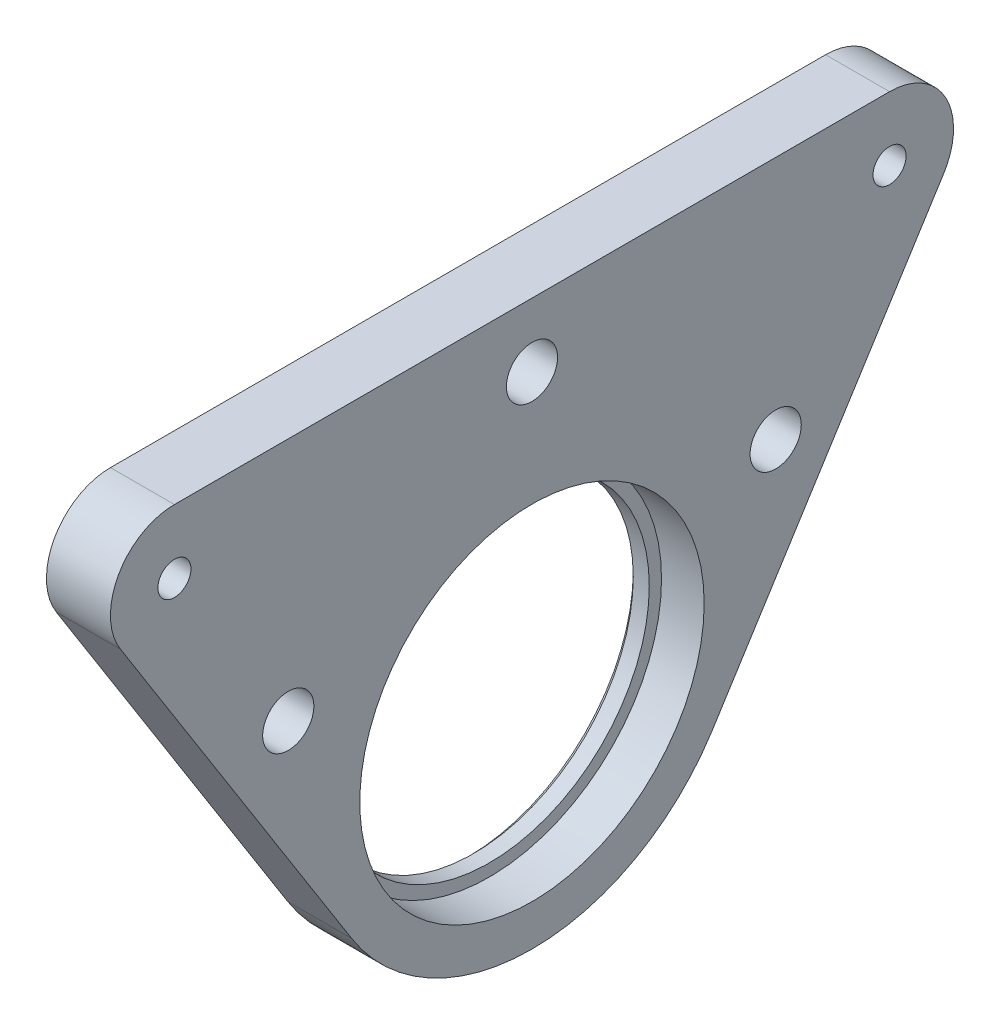
ISO-10303-21;
HEADER;
FILE_DESCRIPTION(('STEP AP214'),'2;1');
FILE_NAME('part.step','',(''),(''),'','','');
FILE_SCHEMA(('AUTOMOTIVE_DESIGN { 1 0 10303 214 1 1 1 1 }'));
ENDSEC;
DATA;
#1=APPLICATION_CONTEXT('core data for automotive mechanical design processes');
#2=APPLICATION_PROTOCOL_DEFINITION('international standard','automotive_design',2000,#1);
#3=PRODUCT_CONTEXT('',#1,'mechanical');
#4=PRODUCT('Part','Part','',(#3));
#5=PRODUCT_RELATED_PRODUCT_CATEGORY('part','',(#4));
#6=PRODUCT_DEFINITION_FORMATION('','',#4);
#7=PRODUCT_DEFINITION_CONTEXT('part definition',#1,'design');
#8=PRODUCT_DEFINITION('design','',#6,#7);
#9=PRODUCT_DEFINITION_SHAPE('','',#8);
#10=(LENGTH_UNIT() NAMED_UNIT(*) SI_UNIT(.MILLI.,.METRE.));
#11=(NAMED_UNIT(*) PLANE_ANGLE_UNIT() SI_UNIT($,.RADIAN.));
#12=(NAMED_UNIT(*) SI_UNIT($,.STERADIAN.) SOLID_ANGLE_UNIT());
#13=UNCERTAINTY_MEASURE_WITH_UNIT(LENGTH_MEASURE(1.E-05),#10,'distance_accuracy_value','');
#14=(GEOMETRIC_REPRESENTATION_CONTEXT(3) GLOBAL_UNCERTAINTY_ASSIGNED_CONTEXT((#13)) GLOBAL_UNIT_ASSIGNED_CONTEXT((#10,
#11,#12)) REPRESENTATION_CONTEXT('',''));
#15=CARTESIAN_POINT('',(0.,0.,0.));
#16=DIRECTION('',(0.,0.,1.));
#17=DIRECTION('',(1.,0.,0.));
#18=AXIS2_PLACEMENT_3D('',#15,#16,#17);
#19=CARTESIAN_POINT('',(2.,0.,0.));
#20=DIRECTION('',(1.,0.,0.));
#21=DIRECTION('',(0.,0.,-1.));
#22=AXIS2_PLACEMENT_3D('',#19,#20,#21);
#23=PLANE('',#22);
#24=CARTESIAN_POINT('',(2.,0.,0.));
#25=DIRECTION('',(1.,0.,0.));
#26=DIRECTION('',(0.,0.,-1.));
#27=AXIS2_PLACEMENT_3D('',#24,#25,#26);
#28=CIRCLE('',#27,15.);
#29=CARTESIAN_POINT('',(2.,0.,-15.));
#30=VERTEX_POINT('',#29);
#31=EDGE_CURVE('E163',#30,#30,#28,.T.);
#32=ORIENTED_EDGE('',*,*,#31,.F.);
#33=EDGE_LOOP('',(#32));
#34=FACE_BOUND('',#33,.T.);
#35=CARTESIAN_POINT('',(2.,0.,0.));
#36=DIRECTION('',(1.,0.,0.));
#37=DIRECTION('',(0.,0.,-1.));
#38=AXIS2_PLACEMENT_3D('',#35,#36,#37);
#39=CIRCLE('',#38,16.15);
#40=CARTESIAN_POINT('',(2.,0.,-16.15));
#41=VERTEX_POINT('',#40);
#42=EDGE_CURVE('E263',#41,#41,#39,.F.);
#43=ORIENTED_EDGE('',*,*,#42,.F.);
#44=EDGE_LOOP('',(#43));
#45=FACE_BOUND('',#44,.T.);
#46=ADVANCED_FACE('F46',(#34,#45),#23,.T.);
#47=CARTESIAN_POINT('',(0.,0.,0.));
#48=DIRECTION('',(1.,0.,0.));
#49=DIRECTION('',(0.,0.,-1.));
#50=AXIS2_PLACEMENT_3D('',#47,#48,#49);
#51=PLANE('',#50);
#52=CARTESIAN_POINT('',(0.,0.,0.));
#53=DIRECTION('',(1.,0.,0.));
#54=DIRECTION('',(0.,0.,-1.));
#55=AXIS2_PLACEMENT_3D('',#52,#53,#54);
#56=CIRCLE('',#55,15.5);
#57=CARTESIAN_POINT('',(0.,0.,-15.5));
#58=VERTEX_POINT('',#57);
#59=EDGE_CURVE('E56',#58,#58,#56,.T.);
#60=ORIENTED_EDGE('',*,*,#59,.T.);
#61=EDGE_LOOP('',(#60));
#62=FACE_BOUND('',#61,.T.);
#63=CARTESIAN_POINT('',(0.,9.97181490150372,22.856187860574));
#64=DIRECTION('',(1.,0.,0.));
#65=DIRECTION('',(0.,0.,-1.));
#66=AXIS2_PLACEMENT_3D('',#63,#64,#65);
#67=CIRCLE('',#66,2.4);
#68=CARTESIAN_POINT('',(0.,9.97181490150372,20.456187860574));
#69=VERTEX_POINT('',#68);
#70=EDGE_CURVE('E128',#69,#69,#67,.F.);
#71=ORIENTED_EDGE('',*,*,#70,.F.);
#72=EDGE_LOOP('',(#71));
#73=FACE_BOUND('',#72,.T.);
#74=CARTESIAN_POINT('',(0.,9.97181490150372,-22.856187860574));
#75=DIRECTION('',(1.,0.,0.));
#76=DIRECTION('',(0.,0.,-1.));
#77=AXIS2_PLACEMENT_3D('',#74,#75,#76);
#78=CIRCLE('',#77,2.4);
#79=CARTESIAN_POINT('',(0.,9.97181490150372,-25.256187860574));
#80=VERTEX_POINT('',#79);
#81=EDGE_CURVE('E235',#80,#80,#78,.F.);
#82=ORIENTED_EDGE('',*,*,#81,.F.);
#83=EDGE_LOOP('',(#82));
#84=FACE_BOUND('',#83,.T.);
#85=CARTESIAN_POINT('',(0.,26.8817099586865,0.));
#86=DIRECTION('',(1.,0.,0.));
#87=DIRECTION('',(0.,0.,-1.));
#88=AXIS2_PLACEMENT_3D('',#85,#86,#87);
#89=CIRCLE('',#88,2.4);
#90=CARTESIAN_POINT('',(0.,26.8817099586865,-2.4));
#91=VERTEX_POINT('',#90);
#92=EDGE_CURVE('E236',#91,#91,#89,.F.);
#93=ORIENTED_EDGE('',*,*,#92,.F.);
#94=EDGE_LOOP('',(#93));
#95=FACE_BOUND('',#94,.T.);
#96=CARTESIAN_POINT('',(0.,0.,0.));
#97=DIRECTION('',(1.,0.,0.));
#98=DIRECTION('',(0.,0.,-1.));
#99=AXIS2_PLACEMENT_3D('',#96,#97,#98);
#100=CIRCLE('',#99,20.);
#101=CARTESIAN_POINT('',(0.,-10.6796745809535,16.9098950571828));
#102=VERTEX_POINT('',#101);
#103=CARTESIAN_POINT('',(0.,-10.6796745809535,-16.9098950571828));
#104=VERTEX_POINT('',#103);
#105=EDGE_CURVE('E167',#102,#104,#100,.T.);
#106=ORIENTED_EDGE('',*,*,#105,.F.);
#107=DIRECTION('',(0.,0.845494752859142,0.533983729047674));
#108=VECTOR('',#107,1.);
#109=CARTESIAN_POINT('',(0.,23.6778075844005,38.6088309586823));
#110=LINE('',#109,#108);
#111=CARTESIAN_POINT('',(0.,23.6778075844005,38.6088309586823));
#112=VERTEX_POINT('',#111);
#113=EDGE_CURVE('E87',#102,#112,#110,.T.);
#114=ORIENTED_EDGE('',*,*,#113,.T.);
#115=CARTESIAN_POINT('',(0.,26.8817099586865,33.5358624415275));
#116=DIRECTION('',(1.,0.,0.));
#117=DIRECTION('',(0.,0.,-1.));
#118=AXIS2_PLACEMENT_3D('',#115,#116,#117);
#119=CIRCLE('',#118,6.);
#120=CARTESIAN_POINT('',(0.,32.8817099586866,33.5358624415275));
#121=VERTEX_POINT('',#120);
#122=EDGE_CURVE('E72',#112,#121,#119,.F.);
#123=ORIENTED_EDGE('',*,*,#122,.T.);
#124=DIRECTION('',(0.,0.,-1.));
#125=VECTOR('',#124,1.);
#126=CARTESIAN_POINT('',(0.,32.8817099586866,33.5358624415275));
#127=LINE('',#126,#125);
#128=CARTESIAN_POINT('',(0.,32.8817099586866,-33.5358624415275));
#129=VERTEX_POINT('',#128);
#130=EDGE_CURVE('E221',#121,#129,#127,.T.);
#131=ORIENTED_EDGE('',*,*,#130,.T.);
#132=CARTESIAN_POINT('',(0.,26.8817099586866,-33.5358624415275));
#133=DIRECTION('',(1.,0.,0.));
#134=DIRECTION('',(0.,0.,-1.));
#135=AXIS2_PLACEMENT_3D('',#132,#133,#134);
#136=CIRCLE('',#135,6.00000000000001);
#137=CARTESIAN_POINT('',(0.,23.6778075844005,-38.6088309586823));
#138=VERTEX_POINT('',#137);
#139=EDGE_CURVE('E219',#129,#138,#136,.F.);
#140=ORIENTED_EDGE('',*,*,#139,.T.);
#141=DIRECTION('',(0.,-0.845494752859142,0.533983729047674));
#142=VECTOR('',#141,1.);
#143=CARTESIAN_POINT('',(0.,-10.6796745809535,-16.9098950571828));
#144=LINE('',#143,#142);
#145=EDGE_CURVE('E147',#138,#104,#144,.T.);
#146=ORIENTED_EDGE('',*,*,#145,.T.);
#147=EDGE_LOOP('',(#106,#114,#123,#131,#140,#146));
#148=FACE_BOUND('',#147,.T.);
#149=CARTESIAN_POINT('',(0.,26.8817099586866,-33.5358624415275));
#150=DIRECTION('',(1.,0.,0.));
#151=DIRECTION('',(0.,0.,-1.));
#152=AXIS2_PLACEMENT_3D('',#149,#150,#151);
#153=CIRCLE('',#152,1.55);
#154=CARTESIAN_POINT('',(0.,26.8817099586866,-35.0858624415275));
#155=VERTEX_POINT('',#154);
#156=EDGE_CURVE('E240',#155,#155,#153,.T.);
#157=ORIENTED_EDGE('',*,*,#156,.T.);
#158=EDGE_LOOP('',(#157));
#159=FACE_BOUND('',#158,.T.);
#160=CARTESIAN_POINT('',(0.,26.8817099586865,33.5358624415275));
#161=DIRECTION('',(1.,0.,0.));
#162=DIRECTION('',(0.,0.,-1.));
#163=AXIS2_PLACEMENT_3D('',#160,#161,#162);
#164=CIRCLE('',#163,1.55);
#165=CARTESIAN_POINT('',(0.,26.8817099586865,31.9858624415275));
#166=VERTEX_POINT('',#165);
#167=EDGE_CURVE('E259',#166,#166,#164,.T.);
#168=ORIENTED_EDGE('',*,*,#167,.T.);
#169=EDGE_LOOP('',(#168));
#170=FACE_BOUND('',#169,.T.);
#171=ADVANCED_FACE('F174',(#62,#73,#84,#95,#148,#159,#170),#51,.F.);
#172=CARTESIAN_POINT('',(2.,0.,0.));
#173=DIRECTION('',(-1.,0.,0.));
#174=DIRECTION('',(0.,0.,1.));
#175=AXIS2_PLACEMENT_3D('',#172,#173,#174);
#176=CYLINDRICAL_SURFACE('',#175,20.);
#177=CARTESIAN_POINT('',(6.,0.,0.));
#178=DIRECTION('',(1.,0.,0.));
#179=DIRECTION('',(0.,0.,-1.));
#180=AXIS2_PLACEMENT_3D('',#177,#178,#179);
#181=CIRCLE('',#180,20.);
#182=CARTESIAN_POINT('',(6.,-10.6796745809535,16.9098950571828));
#183=VERTEX_POINT('',#182);
#184=CARTESIAN_POINT('',(6.,-10.6796745809535,-16.9098950571828));
#185=VERTEX_POINT('',#184);
#186=EDGE_CURVE('E160',#183,#185,#181,.T.);
#187=ORIENTED_EDGE('',*,*,#186,.F.);
#188=DIRECTION('',(1.,0.,0.));
#189=VECTOR('',#188,1.);
#190=CARTESIAN_POINT('',(-90.2769732489516,-10.6796745809535,16.9098950571828));
#191=LINE('',#190,#189);
#192=EDGE_CURVE('E116',#102,#183,#191,.T.);
#193=ORIENTED_EDGE('',*,*,#192,.F.);
#194=ORIENTED_EDGE('',*,*,#105,.T.);
#195=DIRECTION('',(1.,0.,0.));
#196=VECTOR('',#195,1.);
#197=CARTESIAN_POINT('',(-90.2769732489516,-10.6796745809535,-16.9098950571828));
#198=LINE('',#197,#196);
#199=EDGE_CURVE('E154',#104,#185,#198,.T.);
#200=ORIENTED_EDGE('',*,*,#199,.T.);
#201=EDGE_LOOP('',(#187,#193,#194,#200));
#202=FACE_BOUND('',#201,.T.);
#203=ADVANCED_FACE('F194',(#202),#176,.T.);
#204=CARTESIAN_POINT('',(2.,0.,0.));
#205=DIRECTION('',(-1.,0.,0.));
#206=DIRECTION('',(0.,0.,1.));
#207=AXIS2_PLACEMENT_3D('',#204,#205,#206);
#208=CYLINDRICAL_SURFACE('',#207,15.);
#209=CARTESIAN_POINT('',(0.49999999999999,0.,0.));
#210=DIRECTION('',(1.,0.,0.));
#211=DIRECTION('',(0.,0.,-1.));
#212=AXIS2_PLACEMENT_3D('',#209,#210,#211);
#213=CIRCLE('',#212,15.);
#214=CARTESIAN_POINT('',(0.49999999999999,0.,-15.));
#215=VERTEX_POINT('',#214);
#216=EDGE_CURVE('E11',#215,#215,#213,.F.);
#217=ORIENTED_EDGE('',*,*,#216,.T.);
#218=EDGE_LOOP('',(#217));
#219=FACE_BOUND('',#218,.T.);
#220=ORIENTED_EDGE('',*,*,#31,.T.);
#221=EDGE_LOOP('',(#220));
#222=FACE_BOUND('',#221,.T.);
#223=ADVANCED_FACE('F199',(#219,#222),#208,.F.);
#224=CARTESIAN_POINT('',(6.,0.,0.));
#225=DIRECTION('',(1.,0.,0.));
#226=DIRECTION('',(0.,0.,-1.));
#227=AXIS2_PLACEMENT_3D('',#224,#225,#226);
#228=PLANE('',#227);
#229=CARTESIAN_POINT('',(6.,0.,0.));
#230=DIRECTION('',(1.,0.,0.));
#231=DIRECTION('',(0.,0.,-1.));
#232=AXIS2_PLACEMENT_3D('',#229,#230,#231);
#233=CIRCLE('',#232,16.15);
#234=CARTESIAN_POINT('',(6.,0.,-16.15));
#235=VERTEX_POINT('',#234);
#236=EDGE_CURVE('E267',#235,#235,#233,.T.);
#237=ORIENTED_EDGE('',*,*,#236,.F.);
#238=EDGE_LOOP('',(#237));
#239=FACE_BOUND('',#238,.T.);
#240=CARTESIAN_POINT('',(6.,9.97181490150372,22.856187860574));
#241=DIRECTION('',(1.,0.,0.));
#242=DIRECTION('',(0.,0.,-1.));
#243=AXIS2_PLACEMENT_3D('',#240,#241,#242);
#244=CIRCLE('',#243,2.4);
#245=CARTESIAN_POINT('',(6.,9.97181490150372,20.456187860574));
#246=VERTEX_POINT('',#245);
#247=EDGE_CURVE('E132',#246,#246,#244,.T.);
#248=ORIENTED_EDGE('',*,*,#247,.F.);
#249=EDGE_LOOP('',(#248));
#250=FACE_BOUND('',#249,.T.);
#251=CARTESIAN_POINT('',(6.,9.97181490150372,-22.856187860574));
#252=DIRECTION('',(1.,0.,0.));
#253=DIRECTION('',(0.,0.,1.));
#254=AXIS2_PLACEMENT_3D('',#251,#252,#253);
#255=CIRCLE('',#254,2.4);
#256=CARTESIAN_POINT('',(6.,9.97181490150372,-20.456187860574));
#257=VERTEX_POINT('',#256);
#258=EDGE_CURVE('E241',#257,#257,#255,.T.);
#259=ORIENTED_EDGE('',*,*,#258,.F.);
#260=EDGE_LOOP('',(#259));
#261=FACE_BOUND('',#260,.T.);
#262=CARTESIAN_POINT('',(6.,26.8817099586865,0.));
#263=DIRECTION('',(1.,0.,0.));
#264=DIRECTION('',(0.,0.,-1.));
#265=AXIS2_PLACEMENT_3D('',#262,#263,#264);
#266=CIRCLE('',#265,2.4);
#267=CARTESIAN_POINT('',(6.,26.8817099586865,-2.4));
#268=VERTEX_POINT('',#267);
#269=EDGE_CURVE('E231',#268,#268,#266,.T.);
#270=ORIENTED_EDGE('',*,*,#269,.F.);
#271=EDGE_LOOP('',(#270));
#272=FACE_BOUND('',#271,.T.);
#273=ORIENTED_EDGE('',*,*,#186,.T.);
#274=DIRECTION('',(0.,0.845494752859141,-0.533983729047674));
#275=VECTOR('',#274,1.);
#276=CARTESIAN_POINT('',(6.,-10.6796745809535,-16.9098950571828));
#277=LINE('',#276,#275);
#278=CARTESIAN_POINT('',(6.,23.6778075844005,-38.6088309586823));
#279=VERTEX_POINT('',#278);
#280=EDGE_CURVE('E122',#185,#279,#277,.T.);
#281=ORIENTED_EDGE('',*,*,#280,.T.);
#282=CARTESIAN_POINT('',(6.,26.8817099586866,-33.5358624415275));
#283=DIRECTION('',(1.,0.,0.));
#284=DIRECTION('',(0.,0.,-1.));
#285=AXIS2_PLACEMENT_3D('',#282,#283,#284);
#286=CIRCLE('',#285,6.00000000000001);
#287=CARTESIAN_POINT('',(6.,32.8817099586866,-33.5358624415275));
#288=VERTEX_POINT('',#287);
#289=EDGE_CURVE('E140',#279,#288,#286,.T.);
#290=ORIENTED_EDGE('',*,*,#289,.T.);
#291=DIRECTION('',(0.,0.,1.));
#292=VECTOR('',#291,1.);
#293=CARTESIAN_POINT('',(6.,32.8817099586866,33.5358624415275));
#294=LINE('',#293,#292);
#295=CARTESIAN_POINT('',(6.,32.8817099586866,33.5358624415275));
#296=VERTEX_POINT('',#295);
#297=EDGE_CURVE('E117',#288,#296,#294,.T.);
#298=ORIENTED_EDGE('',*,*,#297,.T.);
#299=CARTESIAN_POINT('',(6.,26.8817099586865,33.5358624415275));
#300=DIRECTION('',(1.,0.,0.));
#301=DIRECTION('',(0.,0.,-1.));
#302=AXIS2_PLACEMENT_3D('',#299,#300,#301);
#303=CIRCLE('',#302,6.);
#304=CARTESIAN_POINT('',(6.,23.6778075844005,38.6088309586823));
#305=VERTEX_POINT('',#304);
#306=EDGE_CURVE('E113',#296,#305,#303,.T.);
#307=ORIENTED_EDGE('',*,*,#306,.T.);
#308=DIRECTION('',(0.,-0.845494752859141,-0.533983729047673));
#309=VECTOR('',#308,1.);
#310=CARTESIAN_POINT('',(6.,23.6778075844005,38.6088309586823));
#311=LINE('',#310,#309);
#312=EDGE_CURVE('E63',#305,#183,#311,.T.);
#313=ORIENTED_EDGE('',*,*,#312,.T.);
#314=EDGE_LOOP('',(#273,#281,#290,#298,#307,#313));
#315=FACE_BOUND('',#314,.T.);
#316=CARTESIAN_POINT('',(6.,26.8817099586866,-33.5358624415275));
#317=DIRECTION('',(1.,0.,0.));
#318=DIRECTION('',(0.,0.,-1.));
#319=AXIS2_PLACEMENT_3D('',#316,#317,#318);
#320=CIRCLE('',#319,1.55);
#321=CARTESIAN_POINT('',(6.,26.8817099586866,-35.0858624415275));
#322=VERTEX_POINT('',#321);
#323=EDGE_CURVE('E251',#322,#322,#320,.T.);
#324=ORIENTED_EDGE('',*,*,#323,.F.);
#325=EDGE_LOOP('',(#324));
#326=FACE_BOUND('',#325,.T.);
#327=CARTESIAN_POINT('',(6.,26.8817099586865,33.5358624415275));
#328=DIRECTION('',(1.,0.,0.));
#329=DIRECTION('',(0.,0.,-1.));
#330=AXIS2_PLACEMENT_3D('',#327,#328,#329);
#331=CIRCLE('',#330,1.55);
#332=CARTESIAN_POINT('',(6.,26.8817099586865,31.9858624415275));
#333=VERTEX_POINT('',#332);
#334=EDGE_CURVE('E255',#333,#333,#331,.T.);
#335=ORIENTED_EDGE('',*,*,#334,.F.);
#336=EDGE_LOOP('',(#335));
#337=FACE_BOUND('',#336,.T.);
#338=ADVANCED_FACE('F124',(#239,#250,#261,#272,#315,#326,#337),#228,.T.);
#339=CARTESIAN_POINT('',(-90.2769732489516,23.6778075844005,38.6088309586823));
#340=DIRECTION('',(0.,-0.533983729047673,0.845494752859141));
#341=DIRECTION('',(0.,-0.845494752859142,-0.533983729047674));
#342=AXIS2_PLACEMENT_3D('',#339,#340,#341);
#343=PLANE('',#342);
#344=ORIENTED_EDGE('',*,*,#113,.F.);
#345=ORIENTED_EDGE('',*,*,#192,.T.);
#346=ORIENTED_EDGE('',*,*,#312,.F.);
#347=DIRECTION('',(1.,0.,0.));
#348=VECTOR('',#347,1.);
#349=CARTESIAN_POINT('',(-90.2769732489516,23.6778075844005,38.6088309586823));
#350=LINE('',#349,#348);
#351=EDGE_CURVE('E111',#112,#305,#350,.T.);
#352=ORIENTED_EDGE('',*,*,#351,.F.);
#353=EDGE_LOOP('',(#344,#345,#346,#352));
#354=FACE_BOUND('',#353,.T.);
#355=ADVANCED_FACE('F119',(#354),#343,.T.);
#356=CARTESIAN_POINT('',(-90.2769732489516,-10.6796745809535,-16.9098950571828));
#357=DIRECTION('',(0.,-0.533983729047674,-0.845494752859141));
#358=DIRECTION('',(0.,0.845494752859142,-0.533983729047674));
#359=AXIS2_PLACEMENT_3D('',#356,#357,#358);
#360=PLANE('',#359);
#361=ORIENTED_EDGE('',*,*,#145,.F.);
#362=DIRECTION('',(1.,0.,0.));
#363=VECTOR('',#362,1.);
#364=CARTESIAN_POINT('',(-90.2769732489516,23.6778075844005,-38.6088309586823));
#365=LINE('',#364,#363);
#366=EDGE_CURVE('E151',#138,#279,#365,.T.);
#367=ORIENTED_EDGE('',*,*,#366,.T.);
#368=ORIENTED_EDGE('',*,*,#280,.F.);
#369=ORIENTED_EDGE('',*,*,#199,.F.);
#370=EDGE_LOOP('',(#361,#367,#368,#369));
#371=FACE_BOUND('',#370,.T.);
#372=ADVANCED_FACE('F213',(#371),#360,.T.);
#373=CARTESIAN_POINT('',(-90.2769732489516,26.8817099586866,-33.5358624415275));
#374=DIRECTION('',(1.,0.,0.));
#375=DIRECTION('',(0.,0.,-1.));
#376=AXIS2_PLACEMENT_3D('',#373,#374,#375);
#377=CYLINDRICAL_SURFACE('',#376,6.00000000000001);
#378=ORIENTED_EDGE('',*,*,#139,.F.);
#379=DIRECTION('',(1.,0.,0.));
#380=VECTOR('',#379,1.);
#381=CARTESIAN_POINT('',(-90.2769732489516,32.8817099586866,-33.5358624415275));
#382=LINE('',#381,#380);
#383=EDGE_CURVE('E148',#129,#288,#382,.T.);
#384=ORIENTED_EDGE('',*,*,#383,.T.);
#385=ORIENTED_EDGE('',*,*,#289,.F.);
#386=ORIENTED_EDGE('',*,*,#366,.F.);
#387=EDGE_LOOP('',(#378,#384,#385,#386));
#388=FACE_BOUND('',#387,.T.);
#389=ADVANCED_FACE('F217',(#388),#377,.T.);
#390=CARTESIAN_POINT('',(-90.2769732489516,32.8817099586866,33.5358624415275));
#391=DIRECTION('',(0.,1.,0.));
#392=DIRECTION('',(0.,0.,1.));
#393=AXIS2_PLACEMENT_3D('',#390,#391,#392);
#394=PLANE('',#393);
#395=ORIENTED_EDGE('',*,*,#130,.F.);
#396=DIRECTION('',(1.,0.,0.));
#397=VECTOR('',#396,1.);
#398=CARTESIAN_POINT('',(-90.2769732489516,32.8817099586866,33.5358624415275));
#399=LINE('',#398,#397);
#400=EDGE_CURVE('E97',#121,#296,#399,.T.);
#401=ORIENTED_EDGE('',*,*,#400,.T.);
#402=ORIENTED_EDGE('',*,*,#297,.F.);
#403=ORIENTED_EDGE('',*,*,#383,.F.);
#404=EDGE_LOOP('',(#395,#401,#402,#403));
#405=FACE_BOUND('',#404,.T.);
#406=ADVANCED_FACE('F220',(#405),#394,.T.);
#407=CARTESIAN_POINT('',(-90.2769732489516,26.8817099586865,33.5358624415275));
#408=DIRECTION('',(1.,0.,0.));
#409=DIRECTION('',(0.,0.,-1.));
#410=AXIS2_PLACEMENT_3D('',#407,#408,#409);
#411=CYLINDRICAL_SURFACE('',#410,6.);
#412=ORIENTED_EDGE('',*,*,#122,.F.);
#413=ORIENTED_EDGE('',*,*,#351,.T.);
#414=ORIENTED_EDGE('',*,*,#306,.F.);
#415=ORIENTED_EDGE('',*,*,#400,.F.);
#416=EDGE_LOOP('',(#412,#413,#414,#415));
#417=FACE_BOUND('',#416,.T.);
#418=ADVANCED_FACE('F112',(#417),#411,.T.);
#419=CARTESIAN_POINT('',(-6.78822509939086,26.8817099586865,0.));
#420=DIRECTION('',(1.,0.,0.));
#421=DIRECTION('',(0.,0.,-1.));
#422=AXIS2_PLACEMENT_3D('',#419,#420,#421);
#423=CYLINDRICAL_SURFACE('',#422,2.4);
#424=ORIENTED_EDGE('',*,*,#92,.T.);
#425=EDGE_LOOP('',(#424));
#426=FACE_BOUND('',#425,.T.);
#427=ORIENTED_EDGE('',*,*,#269,.T.);
#428=EDGE_LOOP('',(#427));
#429=FACE_BOUND('',#428,.T.);
#430=ADVANCED_FACE('F285',(#426,#429),#423,.F.);
#431=CARTESIAN_POINT('',(-6.78822509939086,9.97181490150372,-22.856187860574));
#432=DIRECTION('',(1.,0.,0.));
#433=DIRECTION('',(0.,0.,-1.));
#434=AXIS2_PLACEMENT_3D('',#431,#432,#433);
#435=CYLINDRICAL_SURFACE('',#434,2.4);
#436=ORIENTED_EDGE('',*,*,#81,.T.);
#437=EDGE_LOOP('',(#436));
#438=FACE_BOUND('',#437,.T.);
#439=ORIENTED_EDGE('',*,*,#258,.T.);
#440=EDGE_LOOP('',(#439));
#441=FACE_BOUND('',#440,.T.);
#442=ADVANCED_FACE('F287',(#438,#441),#435,.F.);
#443=CARTESIAN_POINT('',(-6.78822509939086,9.97181490150372,22.856187860574));
#444=DIRECTION('',(1.,0.,0.));
#445=DIRECTION('',(0.,0.,-1.));
#446=AXIS2_PLACEMENT_3D('',#443,#444,#445);
#447=CYLINDRICAL_SURFACE('',#446,2.4);
#448=ORIENTED_EDGE('',*,*,#70,.T.);
#449=EDGE_LOOP('',(#448));
#450=FACE_BOUND('',#449,.T.);
#451=ORIENTED_EDGE('',*,*,#247,.T.);
#452=EDGE_LOOP('',(#451));
#453=FACE_BOUND('',#452,.T.);
#454=ADVANCED_FACE('F294',(#450,#453),#447,.F.);
#455=CARTESIAN_POINT('',(11.6568542494924,26.8817099586866,-33.5358624415275));
#456=DIRECTION('',(-1.,0.,0.));
#457=DIRECTION('',(0.,0.,1.));
#458=AXIS2_PLACEMENT_3D('',#455,#456,#457);
#459=CYLINDRICAL_SURFACE('',#458,1.55);
#460=ORIENTED_EDGE('',*,*,#156,.F.);
#461=EDGE_LOOP('',(#460));
#462=FACE_BOUND('',#461,.T.);
#463=ORIENTED_EDGE('',*,*,#323,.T.);
#464=EDGE_LOOP('',(#463));
#465=FACE_BOUND('',#464,.T.);
#466=ADVANCED_FACE('F350',(#462,#465),#459,.F.);
#467=CARTESIAN_POINT('',(11.6568542494924,26.8817099586865,33.5358624415275));
#468=DIRECTION('',(-1.,0.,0.));
#469=DIRECTION('',(0.,0.,1.));
#470=AXIS2_PLACEMENT_3D('',#467,#468,#469);
#471=CYLINDRICAL_SURFACE('',#470,1.55);
#472=ORIENTED_EDGE('',*,*,#167,.F.);
#473=EDGE_LOOP('',(#472));
#474=FACE_BOUND('',#473,.T.);
#475=ORIENTED_EDGE('',*,*,#334,.T.);
#476=EDGE_LOOP('',(#475));
#477=FACE_BOUND('',#476,.T.);
#478=ADVANCED_FACE('F183',(#474,#477),#471,.F.);
#479=CARTESIAN_POINT('',(-43.679098064651,0.,0.));
#480=DIRECTION('',(1.,0.,0.));
#481=DIRECTION('',(0.,0.,-1.));
#482=AXIS2_PLACEMENT_3D('',#479,#480,#481);
#483=CYLINDRICAL_SURFACE('',#482,16.15);
#484=ORIENTED_EDGE('',*,*,#42,.T.);
#485=EDGE_LOOP('',(#484));
#486=FACE_BOUND('',#485,.T.);
#487=ORIENTED_EDGE('',*,*,#236,.T.);
#488=EDGE_LOOP('',(#487));
#489=FACE_BOUND('',#488,.T.);
#490=ADVANCED_FACE('F178',(#486,#489),#483,.F.);
#491=CARTESIAN_POINT('',(0.,0.,0.));
#492=DIRECTION('',(-1.,0.,0.));
#493=DIRECTION('',(0.,0.,1.));
#494=AXIS2_PLACEMENT_3D('',#491,#492,#493);
#495=CONICAL_SURFACE('',#494,15.5,0.785398163397443);
#496=ORIENTED_EDGE('',*,*,#216,.F.);
#497=EDGE_LOOP('',(#496));
#498=FACE_BOUND('',#497,.T.);
#499=ORIENTED_EDGE('',*,*,#59,.F.);
#500=EDGE_LOOP('',(#499));
#501=FACE_BOUND('',#500,.T.);
#502=ADVANCED_FACE('F49',(#498,#501),#495,.F.);
#503=CLOSED_SHELL('',(#46,#171,#203,#223,#338,#355,#372,#389,#406,#418,#430,#442,#454,#466,#478,
#490,#502));
#504=MANIFOLD_SOLID_BREP('B2',#503);
#505=ADVANCED_BREP_SHAPE_REPRESENTATION('',(#18,#504),#14);
#506=SHAPE_DEFINITION_REPRESENTATION(#9,#505);
ENDSEC;
END-ISO-10303-21;
